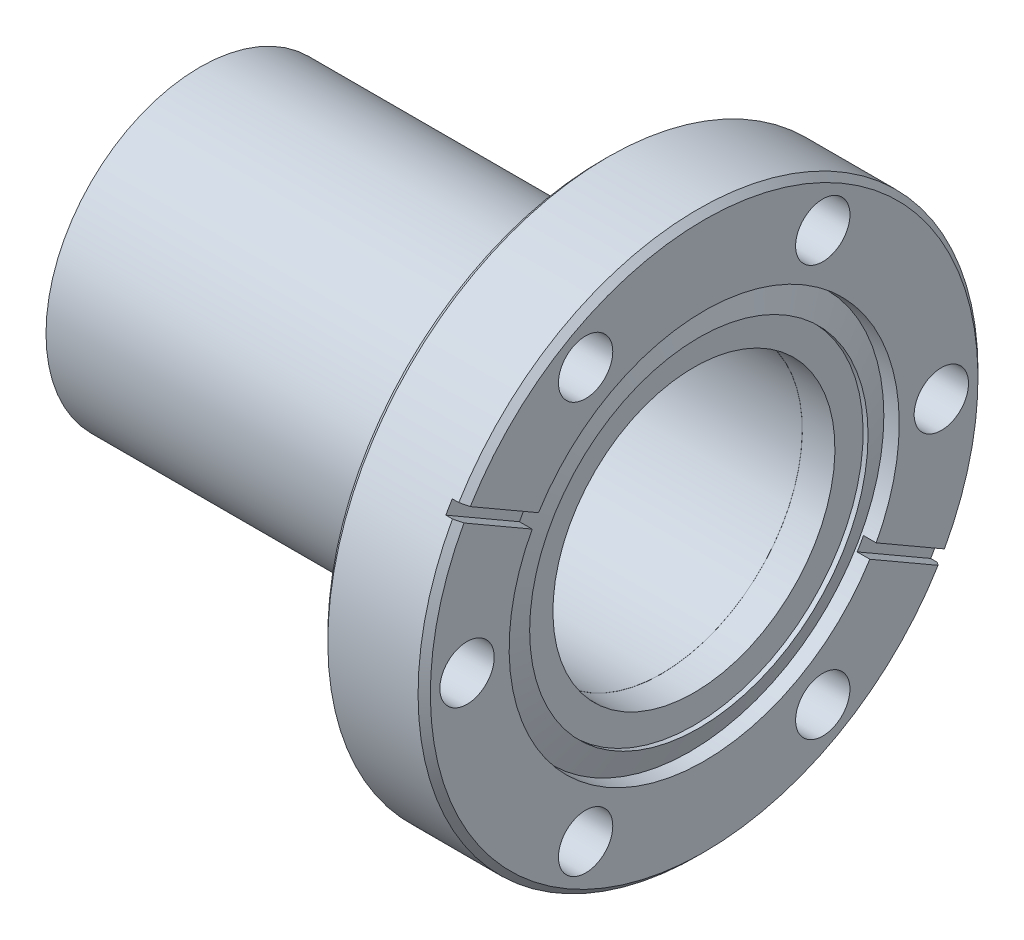
ISO-10303-21;
HEADER;
FILE_DESCRIPTION(('STEP AP214'),'2;1');
FILE_NAME('part.step','',(''),(''),'','','');
FILE_SCHEMA(('AUTOMOTIVE_DESIGN { 1 0 10303 214 1 1 1 1 }'));
ENDSEC;
DATA;
#1=APPLICATION_CONTEXT('core data for automotive mechanical design processes');
#2=APPLICATION_PROTOCOL_DEFINITION('international standard','automotive_design',2000,#1);
#3=PRODUCT_CONTEXT('',#1,'mechanical');
#4=PRODUCT('Part','Part','',(#3));
#5=PRODUCT_RELATED_PRODUCT_CATEGORY('part','',(#4));
#6=PRODUCT_DEFINITION_FORMATION('','',#4);
#7=PRODUCT_DEFINITION_CONTEXT('part definition',#1,'design');
#8=PRODUCT_DEFINITION('design','',#6,#7);
#9=PRODUCT_DEFINITION_SHAPE('','',#8);
#10=(LENGTH_UNIT() NAMED_UNIT(*) SI_UNIT(.MILLI.,.METRE.));
#11=(NAMED_UNIT(*) PLANE_ANGLE_UNIT() SI_UNIT($,.RADIAN.));
#12=(NAMED_UNIT(*) SI_UNIT($,.STERADIAN.) SOLID_ANGLE_UNIT());
#13=UNCERTAINTY_MEASURE_WITH_UNIT(LENGTH_MEASURE(1.E-05),#10,'distance_accuracy_value','');
#14=(GEOMETRIC_REPRESENTATION_CONTEXT(3) GLOBAL_UNCERTAINTY_ASSIGNED_CONTEXT((#13)) GLOBAL_UNIT_ASSIGNED_CONTEXT((#10,
#11,#12)) REPRESENTATION_CONTEXT('',''));
#15=CARTESIAN_POINT('',(0.,0.,0.));
#16=DIRECTION('',(0.,0.,1.));
#17=DIRECTION('',(1.,0.,0.));
#18=AXIS2_PLACEMENT_3D('',#15,#16,#17);
#19=CARTESIAN_POINT('',(7.39140000000005,0.,0.));
#20=DIRECTION('',(-1.,0.,0.));
#21=DIRECTION('',(0.,-1.,0.));
#22=AXIS2_PLACEMENT_3D('',#19,#20,#21);
#23=CYLINDRICAL_SURFACE('',#22,17.4498);
#24=CARTESIAN_POINT('',(7.39140000000005,0.,0.));
#25=DIRECTION('',(-1.,0.,0.));
#26=DIRECTION('',(0.,-1.,0.));
#27=AXIS2_PLACEMENT_3D('',#24,#25,#26);
#28=CIRCLE('',#27,17.4498);
#29=CARTESIAN_POINT('',(7.39140000000005,-17.4498,0.));
#30=VERTEX_POINT('',#29);
#31=EDGE_CURVE('P0_E33',#30,#30,#28,.F.);
#32=ORIENTED_EDGE('',*,*,#31,.T.);
#33=EDGE_LOOP('',(#32));
#34=FACE_BOUND('',#33,.T.);
#35=CARTESIAN_POINT('',(-47.2185999999999,0.,0.));
#36=DIRECTION('',(-1.,0.,0.));
#37=DIRECTION('',(0.,-1.,0.));
#38=AXIS2_PLACEMENT_3D('',#35,#36,#37);
#39=CIRCLE('',#38,17.4498);
#40=CARTESIAN_POINT('',(-47.2186,-17.4498,0.));
#41=VERTEX_POINT('',#40);
#42=EDGE_CURVE('P0_E10',#41,#41,#39,.F.);
#43=ORIENTED_EDGE('',*,*,#42,.F.);
#44=EDGE_LOOP('',(#43));
#45=FACE_BOUND('',#44,.T.);
#46=ADVANCED_FACE('P0_F30',(#34,#45),#23,.F.);
#47=CARTESIAN_POINT('',(-49.7585999999999,0.,0.));
#48=DIRECTION('',(-1.,0.,0.));
#49=DIRECTION('',(0.,-1.,0.));
#50=AXIS2_PLACEMENT_3D('',#47,#48,#49);
#51=PLANE('',#50);
#52=CARTESIAN_POINT('',(-49.7585999999999,0.,0.));
#53=DIRECTION('',(1.,0.,0.));
#54=DIRECTION('',(0.,1.,0.));
#55=AXIS2_PLACEMENT_3D('',#52,#53,#54);
#56=CIRCLE('',#55,19.05);
#57=CARTESIAN_POINT('',(-49.7585999999999,19.05,0.));
#58=VERTEX_POINT('',#57);
#59=EDGE_CURVE('P0_E42',#58,#58,#56,.T.);
#60=ORIENTED_EDGE('',*,*,#59,.F.);
#61=EDGE_LOOP('',(#60));
#62=FACE_BOUND('',#61,.T.);
#63=ADVANCED_FACE('P0_F55',(#62),#51,.T.);
#64=CARTESIAN_POINT('',(7.39140000000005,0.,0.));
#65=DIRECTION('',(-1.,0.,0.));
#66=DIRECTION('',(0.,-1.,0.));
#67=AXIS2_PLACEMENT_3D('',#64,#65,#66);
#68=PLANE('',#67);
#69=CARTESIAN_POINT('',(7.39140000000006,0.,0.));
#70=DIRECTION('',(1.,0.,0.));
#71=DIRECTION('',(0.,1.,0.));
#72=AXIS2_PLACEMENT_3D('',#69,#70,#71);
#73=CIRCLE('',#72,19.05);
#74=CARTESIAN_POINT('',(7.39140000000006,19.05,0.));
#75=VERTEX_POINT('',#74);
#76=EDGE_CURVE('P0_E37',#75,#75,#73,.F.);
#77=ORIENTED_EDGE('',*,*,#76,.F.);
#78=EDGE_LOOP('',(#77));
#79=FACE_BOUND('',#78,.T.);
#80=ORIENTED_EDGE('',*,*,#31,.F.);
#81=EDGE_LOOP('',(#80));
#82=FACE_BOUND('',#81,.T.);
#83=ADVANCED_FACE('P0_F52',(#79,#82),#68,.F.);
#84=CARTESIAN_POINT('',(-49.7585999999999,0.,0.));
#85=DIRECTION('',(1.,0.,0.));
#86=DIRECTION('',(0.,1.,0.));
#87=AXIS2_PLACEMENT_3D('',#84,#85,#86);
#88=CYLINDRICAL_SURFACE('',#87,19.05);
#89=ORIENTED_EDGE('',*,*,#59,.T.);
#90=EDGE_LOOP('',(#89));
#91=FACE_BOUND('',#90,.T.);
#92=ORIENTED_EDGE('',*,*,#76,.T.);
#93=EDGE_LOOP('',(#92));
#94=FACE_BOUND('',#93,.T.);
#95=ADVANCED_FACE('P0_F54',(#91,#94),#88,.T.);
#96=CARTESIAN_POINT('',(-47.2185999999999,0.,0.));
#97=DIRECTION('',(-1.,0.,0.));
#98=DIRECTION('',(0.,-1.,0.));
#99=AXIS2_PLACEMENT_3D('',#96,#97,#98);
#100=PLANE('',#99);
#101=ORIENTED_EDGE('',*,*,#42,.T.);
#102=EDGE_LOOP('',(#101));
#103=FACE_BOUND('',#102,.T.);
#104=ADVANCED_FACE('P0_F62',(#103),#100,.F.);
#105=CLOSED_SHELL('',(#46,#63,#83,#95,#104));
#106=MANIFOLD_SOLID_BREP('P0_B2',#105);
#107=CARTESIAN_POINT('',(11.43,-14.1065506182447,15.4957173004317));
#108=DIRECTION('',(1.,0.,0.));
#109=DIRECTION('',(0.,0.,-1.));
#110=AXIS2_PLACEMENT_3D('',#107,#108,#109);
#111=PLANE('',#110);
#112=CARTESIAN_POINT('',(11.4300000000001,0.,0.));
#113=DIRECTION('',(-1.,0.,0.));
#114=DIRECTION('',(0.,-1.,0.));
#115=AXIS2_PLACEMENT_3D('',#112,#113,#114);
#116=CIRCLE('',#115,20.9550000000001);
#117=CARTESIAN_POINT('',(11.4300000000001,-20.9550000000001,0.));
#118=VERTEX_POINT('',#117);
#119=EDGE_CURVE('P1_E17',#118,#118,#116,.F.);
#120=ORIENTED_EDGE('',*,*,#119,.T.);
#121=EDGE_LOOP('',(#120));
#122=FACE_BOUND('',#121,.T.);
#123=CARTESIAN_POINT('',(11.4300000000001,0.,0.));
#124=DIRECTION('',(-1.,0.,0.));
#125=DIRECTION('',(0.,-1.,0.));
#126=AXIS2_PLACEMENT_3D('',#123,#124,#125);
#127=CIRCLE('',#126,17.4625);
#128=CARTESIAN_POINT('',(11.4300000000001,-17.4625,0.));
#129=VERTEX_POINT('',#128);
#130=EDGE_CURVE('P1_E39',#129,#129,#127,.T.);
#131=ORIENTED_EDGE('',*,*,#130,.T.);
#132=EDGE_LOOP('',(#131));
#133=FACE_BOUND('',#132,.T.);
#134=ADVANCED_FACE('P1_F14',(#122,#133),#111,.T.);
#135=CARTESIAN_POINT('',(12.0396000000005,0.,0.));
#136=DIRECTION('',(-1.,0.,0.));
#137=DIRECTION('',(0.,-1.,0.));
#138=AXIS2_PLACEMENT_3D('',#135,#136,#137);
#139=CYLINDRICAL_SURFACE('',#138,20.9550000000001);
#140=CARTESIAN_POINT('',(12.0396000000004,0.,0.));
#141=DIRECTION('',(-1.,0.,0.));
#142=DIRECTION('',(0.,0.673183040717958,-0.739475891216018));
#143=AXIS2_PLACEMENT_3D('',#140,#141,#142);
#144=CIRCLE('',#143,20.9550000000004);
#145=CARTESIAN_POINT('',(12.0396000000004,14.1065506182451,-15.4957173004319));
#146=VERTEX_POINT('',#145);
#147=EDGE_CURVE('P1_E29',#146,#146,#144,.T.);
#148=ORIENTED_EDGE('',*,*,#147,.F.);
#149=EDGE_LOOP('',(#148));
#150=FACE_BOUND('',#149,.T.);
#151=ORIENTED_EDGE('',*,*,#119,.F.);
#152=EDGE_LOOP('',(#151));
#153=FACE_BOUND('',#152,.T.);
#154=ADVANCED_FACE('P1_F48',(#150,#153),#139,.F.);
#155=CARTESIAN_POINT('',(12.0396000000005,0.,0.));
#156=DIRECTION('',(-1.,0.,0.));
#157=DIRECTION('',(0.,-1.,0.));
#158=AXIS2_PLACEMENT_3D('',#155,#156,#157);
#159=CYLINDRICAL_SURFACE('',#158,17.4625);
#160=CARTESIAN_POINT('',(7.3914000000001,0.,0.));
#161=DIRECTION('',(-1.,0.,0.));
#162=DIRECTION('',(0.,-1.,0.));
#163=AXIS2_PLACEMENT_3D('',#160,#161,#162);
#164=CIRCLE('',#163,17.4625);
#165=CARTESIAN_POINT('',(7.3914000000001,-17.4625,0.));
#166=VERTEX_POINT('',#165);
#167=EDGE_CURVE('P1_E37',#166,#166,#164,.F.);
#168=ORIENTED_EDGE('',*,*,#167,.F.);
#169=EDGE_LOOP('',(#168));
#170=FACE_BOUND('',#169,.T.);
#171=ORIENTED_EDGE('',*,*,#130,.F.);
#172=EDGE_LOOP('',(#171));
#173=FACE_BOUND('',#172,.T.);
#174=ADVANCED_FACE('P1_F50',(#170,#173),#159,.F.);
#175=CARTESIAN_POINT('',(10.9209738820066,0.,0.));
#176=DIRECTION('',(-1.,0.,0.));
#177=DIRECTION('',(0.,-1.,0.));
#178=AXIS2_PLACEMENT_3D('',#175,#176,#177);
#179=CONICAL_SURFACE('',#178,24.0283999999998,1.22173047639595);
#180=CARTESIAN_POINT('',(10.9209738820065,0.,0.));
#181=DIRECTION('',(-1.,0.,0.));
#182=DIRECTION('',(0.,-1.,0.));
#183=AXIS2_PLACEMENT_3D('',#180,#181,#182);
#184=CIRCLE('',#183,24.0284);
#185=CARTESIAN_POINT('',(10.9209738820065,-24.0284,0.));
#186=VERTEX_POINT('',#185);
#187=EDGE_CURVE('P1_E36',#186,#186,#184,.T.);
#188=ORIENTED_EDGE('',*,*,#187,.F.);
#189=EDGE_LOOP('',(#188));
#190=FACE_BOUND('',#189,.T.);
#191=ORIENTED_EDGE('',*,*,#147,.T.);
#192=EDGE_LOOP('',(#191));
#193=FACE_BOUND('',#192,.T.);
#194=ADVANCED_FACE('P1_F57',(#190,#193),#179,.T.);
#195=CARTESIAN_POINT('',(7.39140000000005,-11.7554588485375,12.9130977503597));
#196=DIRECTION('',(-1.,0.,0.));
#197=DIRECTION('',(0.,0.,1.));
#198=AXIS2_PLACEMENT_3D('',#195,#196,#197);
#199=PLANE('',#198);
#200=ORIENTED_EDGE('',*,*,#167,.T.);
#201=EDGE_LOOP('',(#200));
#202=FACE_BOUND('',#201,.T.);
#203=CARTESIAN_POINT('',(7.39140000000007,0.,0.));
#204=DIRECTION('',(-1.,0.,0.));
#205=DIRECTION('',(0.,-1.,0.));
#206=AXIS2_PLACEMENT_3D('',#203,#204,#205);
#207=CIRCLE('',#206,19.177);
#208=CARTESIAN_POINT('',(7.39140000000007,-19.177,0.));
#209=VERTEX_POINT('',#208);
#210=EDGE_CURVE('P1_E32',#209,#209,#207,.T.);
#211=ORIENTED_EDGE('',*,*,#210,.T.);
#212=EDGE_LOOP('',(#211));
#213=FACE_BOUND('',#212,.T.);
#214=ADVANCED_FACE('P1_F83',(#202,#213),#199,.T.);
#215=CARTESIAN_POINT('',(12.0396000000005,0.,0.));
#216=DIRECTION('',(-1.,0.,0.));
#217=DIRECTION('',(0.,-1.,0.));
#218=AXIS2_PLACEMENT_3D('',#215,#216,#217);
#219=CYLINDRICAL_SURFACE('',#218,24.0284);
#220=CARTESIAN_POINT('',(5.84199999999986,0.,0.));
#221=DIRECTION('',(1.,0.,0.));
#222=DIRECTION('',(0.,-0.673183040717958,0.739475891216018));
#223=AXIS2_PLACEMENT_3D('',#220,#221,#222);
#224=CIRCLE('',#223,24.0284);
#225=CARTESIAN_POINT('',(5.84199999999986,-16.1755113755874,17.7684225044949));
#226=VERTEX_POINT('',#225);
#227=EDGE_CURVE('P1_E35',#226,#226,#224,.F.);
#228=ORIENTED_EDGE('',*,*,#227,.F.);
#229=EDGE_LOOP('',(#228));
#230=FACE_BOUND('',#229,.T.);
#231=ORIENTED_EDGE('',*,*,#187,.T.);
#232=EDGE_LOOP('',(#231));
#233=FACE_BOUND('',#232,.T.);
#234=ADVANCED_FACE('P1_F79',(#230,#233),#219,.T.);
#235=CARTESIAN_POINT('',(12.0396000000005,0.,0.));
#236=DIRECTION('',(-1.,0.,0.));
#237=DIRECTION('',(0.,-1.,0.));
#238=AXIS2_PLACEMENT_3D('',#235,#236,#237);
#239=CYLINDRICAL_SURFACE('',#238,19.177);
#240=CARTESIAN_POINT('',(5.84200000000009,0.,0.));
#241=DIRECTION('',(-1.,0.,0.));
#242=DIRECTION('',(0.,0.673183040717958,-0.739475891216018));
#243=AXIS2_PLACEMENT_3D('',#240,#241,#242);
#244=CIRCLE('',#243,19.177);
#245=CARTESIAN_POINT('',(5.84200000000009,12.9096311718483,-14.1809291658496));
#246=VERTEX_POINT('',#245);
#247=EDGE_CURVE('P1_E26',#246,#246,#244,.T.);
#248=ORIENTED_EDGE('',*,*,#247,.T.);
#249=EDGE_LOOP('',(#248));
#250=FACE_BOUND('',#249,.T.);
#251=ORIENTED_EDGE('',*,*,#210,.F.);
#252=EDGE_LOOP('',(#251));
#253=FACE_BOUND('',#252,.T.);
#254=ADVANCED_FACE('P1_F75',(#250,#253),#239,.F.);
#255=CARTESIAN_POINT('',(5.84199999999986,0.,0.));
#256=DIRECTION('',(1.,0.,0.));
#257=DIRECTION('',(0.,1.,0.));
#258=AXIS2_PLACEMENT_3D('',#255,#256,#257);
#259=CONICAL_SURFACE('',#258,24.0284,0.785398163397482);
#260=ORIENTED_EDGE('',*,*,#227,.T.);
#261=EDGE_LOOP('',(#260));
#262=FACE_BOUND('',#261,.T.);
#263=CARTESIAN_POINT('',(5.08000000000002,0.,0.));
#264=DIRECTION('',(1.,0.,0.));
#265=DIRECTION('',(0.,1.,0.));
#266=AXIS2_PLACEMENT_3D('',#263,#264,#265);
#267=CIRCLE('',#266,23.2664000000001);
#268=CARTESIAN_POINT('',(5.08000000000003,23.2664000000001,0.));
#269=VERTEX_POINT('',#268);
#270=EDGE_CURVE('P1_E21',#269,#269,#267,.F.);
#271=ORIENTED_EDGE('',*,*,#270,.F.);
#272=EDGE_LOOP('',(#271));
#273=FACE_BOUND('',#272,.T.);
#274=ADVANCED_FACE('P1_F68',(#262,#273),#259,.T.);
#275=CARTESIAN_POINT('',(5.07999999999999,0.,0.));
#276=DIRECTION('',(-1.,0.,0.));
#277=DIRECTION('',(0.,-1.,0.));
#278=AXIS2_PLACEMENT_3D('',#275,#276,#277);
#279=CONICAL_SURFACE('',#278,19.9389999999999,0.785398163397347);
#280=CARTESIAN_POINT('',(5.08000000000003,0.,0.));
#281=DIRECTION('',(-1.,0.,0.));
#282=DIRECTION('',(0.,-1.,0.));
#283=AXIS2_PLACEMENT_3D('',#280,#281,#282);
#284=CIRCLE('',#283,19.9389999999999);
#285=CARTESIAN_POINT('',(5.08000000000003,-19.9389999999999,0.));
#286=VERTEX_POINT('',#285);
#287=EDGE_CURVE('P1_E10',#286,#286,#284,.F.);
#288=ORIENTED_EDGE('',*,*,#287,.F.);
#289=EDGE_LOOP('',(#288));
#290=FACE_BOUND('',#289,.T.);
#291=ORIENTED_EDGE('',*,*,#247,.F.);
#292=EDGE_LOOP('',(#291));
#293=FACE_BOUND('',#292,.T.);
#294=ADVANCED_FACE('P1_F63',(#290,#293),#279,.F.);
#295=CARTESIAN_POINT('',(5.08,-13.4225966488754,14.7444097949561));
#296=DIRECTION('',(-1.,0.,0.));
#297=DIRECTION('',(0.,0.,1.));
#298=AXIS2_PLACEMENT_3D('',#295,#296,#297);
#299=PLANE('',#298);
#300=ORIENTED_EDGE('',*,*,#287,.T.);
#301=EDGE_LOOP('',(#300));
#302=FACE_BOUND('',#301,.T.);
#303=ORIENTED_EDGE('',*,*,#270,.T.);
#304=EDGE_LOOP('',(#303));
#305=FACE_BOUND('',#304,.T.);
#306=ADVANCED_FACE('P1_F61',(#302,#305),#299,.T.);
#307=CLOSED_SHELL('',(#134,#154,#174,#194,#214,#234,#254,#274,#294,#306));
#308=MANIFOLD_SOLID_BREP('P1_B1',#307);
#309=CARTESIAN_POINT('',(11.1252,0.,0.));
#310=DIRECTION('',(1.,0.,0.));
#311=DIRECTION('',(0.,1.,0.));
#312=AXIS2_PLACEMENT_3D('',#309,#310,#311);
#313=PLANE('',#312);
#314=CARTESIAN_POINT('',(11.1252,0.,0.));
#315=DIRECTION('',(-1.,0.,0.));
#316=DIRECTION('',(0.,0.,1.));
#317=AXIS2_PLACEMENT_3D('',#314,#315,#316);
#318=CIRCLE('',#317,34.671);
#319=CARTESIAN_POINT('',(11.1252,18.0129372402592,29.6245224936789));
#320=VERTEX_POINT('',#319);
#321=CARTESIAN_POINT('',(11.1252,16.6491204343794,30.4119224936789));
#322=VERTEX_POINT('',#321);
#323=EDGE_CURVE('P2_E98',#320,#322,#318,.F.);
#324=ORIENTED_EDGE('',*,*,#323,.T.);
#325=DIRECTION('',(0.,-0.499999999999993,-0.866025403784442));
#326=VECTOR('',#325,1.);
#327=CARTESIAN_POINT('',(11.1252,11.3893731197485,21.3017729097639));
#328=LINE('',#327,#326);
#329=CARTESIAN_POINT('',(11.1252,11.3893731197485,21.3017729097639));
#330=VERTEX_POINT('',#329);
#331=EDGE_CURVE('P2_E96',#322,#330,#328,.T.);
#332=ORIENTED_EDGE('',*,*,#331,.T.);
#333=CARTESIAN_POINT('',(11.1252,0.,0.));
#334=DIRECTION('',(1.,0.,0.));
#335=DIRECTION('',(0.,0.,-1.));
#336=AXIS2_PLACEMENT_3D('',#333,#334,#335);
#337=CIRCLE('',#336,24.1554);
#338=CARTESIAN_POINT('',(11.1252,12.7531899256282,20.5143729097639));
#339=VERTEX_POINT('',#338);
#340=EDGE_CURVE('P2_E19',#330,#339,#337,.F.);
#341=ORIENTED_EDGE('',*,*,#340,.T.);
#342=DIRECTION('',(0.,0.499999999999994,0.866025403784442));
#343=VECTOR('',#342,1.);
#344=CARTESIAN_POINT('',(11.1252,18.0129372402592,29.6245224936789));
#345=LINE('',#344,#343);
#346=EDGE_CURVE('P2_E93',#339,#320,#345,.T.);
#347=ORIENTED_EDGE('',*,*,#346,.T.);
#348=EDGE_LOOP('',(#324,#332,#341,#347));
#349=FACE_BOUND('',#348,.T.);
#350=ADVANCED_FACE('P2_F16',(#349),#313,.T.);
#351=CARTESIAN_POINT('',(11.1252,0.,0.));
#352=DIRECTION('',(1.,0.,0.));
#353=DIRECTION('',(0.,1.,0.));
#354=AXIS2_PLACEMENT_3D('',#351,#352,#353);
#355=PLANE('',#354);
#356=CARTESIAN_POINT('',(11.1252,0.,0.));
#357=DIRECTION('',(-1.,0.,0.));
#358=DIRECTION('',(0.,0.,1.));
#359=AXIS2_PLACEMENT_3D('',#356,#357,#358);
#360=CIRCLE('',#359,34.671);
#361=CARTESIAN_POINT('',(11.1252,-18.0129372402594,-29.6245224936787));
#362=VERTEX_POINT('',#361);
#363=CARTESIAN_POINT('',(11.1252,-16.6491204343796,-30.4119224936787));
#364=VERTEX_POINT('',#363);
#365=EDGE_CURVE('P2_E152',#362,#364,#360,.F.);
#366=ORIENTED_EDGE('',*,*,#365,.T.);
#367=DIRECTION('',(0.,0.5,0.866025403784439));
#368=VECTOR('',#367,1.);
#369=CARTESIAN_POINT('',(11.1252,-11.3893731197486,-21.3017729097638));
#370=LINE('',#369,#368);
#371=CARTESIAN_POINT('',(11.1252,-11.3893731197486,-21.3017729097638));
#372=VERTEX_POINT('',#371);
#373=EDGE_CURVE('P2_E149',#364,#372,#370,.T.);
#374=ORIENTED_EDGE('',*,*,#373,.T.);
#375=CARTESIAN_POINT('',(11.1252,0.,0.));
#376=DIRECTION('',(1.,0.,0.));
#377=DIRECTION('',(0.,0.,-1.));
#378=AXIS2_PLACEMENT_3D('',#375,#376,#377);
#379=CIRCLE('',#378,24.1554);
#380=CARTESIAN_POINT('',(11.1252,-12.7531899256283,-20.5143729097638));
#381=VERTEX_POINT('',#380);
#382=EDGE_CURVE('P2_E344',#372,#381,#379,.F.);
#383=ORIENTED_EDGE('',*,*,#382,.T.);
#384=DIRECTION('',(0.,-0.5,-0.866025403784439));
#385=VECTOR('',#384,1.);
#386=CARTESIAN_POINT('',(11.1252,-18.0129372402594,-29.6245224936787));
#387=LINE('',#386,#385);
#388=EDGE_CURVE('P2_E135',#381,#362,#387,.T.);
#389=ORIENTED_EDGE('',*,*,#388,.T.);
#390=EDGE_LOOP('',(#366,#374,#383,#389));
#391=FACE_BOUND('',#390,.T.);
#392=ADVANCED_FACE('P2_F259',(#391),#355,.T.);
#393=CARTESIAN_POINT('',(5.08,0.,0.));
#394=DIRECTION('',(1.,0.,0.));
#395=DIRECTION('',(0.,1.,0.));
#396=AXIS2_PLACEMENT_3D('',#393,#394,#395);
#397=PLANE('',#396);
#398=CARTESIAN_POINT('',(5.08,0.,0.));
#399=DIRECTION('',(1.,0.,0.));
#400=DIRECTION('',(0.,0.,-1.));
#401=AXIS2_PLACEMENT_3D('',#398,#399,#400);
#402=CIRCLE('',#401,19.812);
#403=CARTESIAN_POINT('',(5.08,0.,-19.812));
#404=VERTEX_POINT('',#403);
#405=EDGE_CURVE('P2_E128',#404,#404,#402,.F.);
#406=ORIENTED_EDGE('',*,*,#405,.T.);
#407=EDGE_LOOP('',(#406));
#408=FACE_BOUND('',#407,.T.);
#409=CARTESIAN_POINT('',(5.08,0.,0.));
#410=DIRECTION('',(1.,0.,0.));
#411=DIRECTION('',(0.,0.,-1.));
#412=AXIS2_PLACEMENT_3D('',#409,#410,#411);
#413=CIRCLE('',#412,24.1554);
#414=CARTESIAN_POINT('',(5.08,0.,-24.1554));
#415=VERTEX_POINT('',#414);
#416=EDGE_CURVE('P2_E114',#415,#415,#413,.T.);
#417=ORIENTED_EDGE('',*,*,#416,.T.);
#418=EDGE_LOOP('',(#417));
#419=FACE_BOUND('',#418,.T.);
#420=ADVANCED_FACE('P2_F256',(#408,#419),#397,.T.);
#421=CARTESIAN_POINT('',(11.1252,-11.3893731197486,-21.3017729097638));
#422=DIRECTION('',(0.,0.866025403784439,-0.5));
#423=DIRECTION('',(0.,0.5,0.866025403784439));
#424=AXIS2_PLACEMENT_3D('',#421,#422,#423);
#425=PLANE('',#424);
#426=CARTESIAN_POINT('',(12.7,-16.2680199320119,-29.7518370607878));
#427=CARTESIAN_POINT('',(12.5730003723783,-16.3315368685465,-29.8618516220069));
#428=CARTESIAN_POINT('',(12.4460005585674,-16.3950537120112,-29.9718660220241));
#429=CARTESIAN_POINT('',(12.1920005585674,-16.5220872128004,-30.1918944996544));
#430=CARTESIAN_POINT('',(12.0650003723783,-16.585603870125,-30.3019085772676));
#431=CARTESIAN_POINT('',(11.938,-16.6491204343796,-30.4119224936787));
#432=B_SPLINE_CURVE_WITH_KNOTS('',3,(#426,#427,#428,#429,#430,#431),.UNSPECIFIED.,.F.,.F.,(4,2,
4),(0.,0.538886437856431,1.07777287571284),.UNSPECIFIED.);
#433=CARTESIAN_POINT('',(12.7,-16.2680199320119,-29.7518370607878));
#434=VERTEX_POINT('',#433);
#435=CARTESIAN_POINT('',(11.938,-16.6491204343796,-30.4119224936787));
#436=VERTEX_POINT('',#435);
#437=EDGE_CURVE('P2_E108',#434,#436,#432,.T.);
#438=ORIENTED_EDGE('',*,*,#437,.F.);
#439=DIRECTION('',(0.,-0.499999999999999,-0.866025403784439));
#440=VECTOR('',#439,1.);
#441=CARTESIAN_POINT('',(12.7,-11.3893731197486,-21.3017729097638));
#442=LINE('',#441,#440);
#443=CARTESIAN_POINT('',(12.7,-11.3893731197486,-21.3017729097638));
#444=VERTEX_POINT('',#443);
#445=EDGE_CURVE('P2_E204',#444,#434,#442,.T.);
#446=ORIENTED_EDGE('',*,*,#445,.F.);
#447=DIRECTION('',(1.,0.,0.));
#448=VECTOR('',#447,1.);
#449=CARTESIAN_POINT('',(5.08,-11.3893731197486,-21.3017729097638));
#450=LINE('',#449,#448);
#451=EDGE_CURVE('P2_E124',#444,#372,#450,.F.);
#452=ORIENTED_EDGE('',*,*,#451,.T.);
#453=ORIENTED_EDGE('',*,*,#373,.F.);
#454=DIRECTION('',(-1.,0.,0.));
#455=VECTOR('',#454,1.);
#456=CARTESIAN_POINT('',(12.7,-16.6491204343796,-30.4119224936787));
#457=LINE('',#456,#455);
#458=EDGE_CURVE('P2_E134',#436,#364,#457,.T.);
#459=ORIENTED_EDGE('',*,*,#458,.F.);
#460=EDGE_LOOP('',(#438,#446,#452,#453,#459));
#461=FACE_BOUND('',#460,.T.);
#462=ADVANCED_FACE('P2_F252',(#461),#425,.F.);
#463=CARTESIAN_POINT('',(11.938,0.,0.));
#464=DIRECTION('',(-1.,0.,0.));
#465=DIRECTION('',(0.,0.,1.));
#466=AXIS2_PLACEMENT_3D('',#463,#464,#465);
#467=CONICAL_SURFACE('',#466,34.671,0.785398163397442);
#468=CARTESIAN_POINT('',(11.938,18.0129372402592,29.6245224936789));
#469=CARTESIAN_POINT('',(12.0650003723783,17.9494206760046,29.5145085772677));
#470=CARTESIAN_POINT('',(12.1920005585674,17.88590401868,29.4044944996545));
#471=CARTESIAN_POINT('',(12.4460005585674,17.7588705178907,29.1844660220242));
#472=CARTESIAN_POINT('',(12.5730003723783,17.6953536744261,29.0744516220071));
#473=CARTESIAN_POINT('',(12.7,17.6318367378914,28.9644370607879));
#474=B_SPLINE_CURVE_WITH_KNOTS('',3,(#468,#469,#470,#471,#472,#473),.UNSPECIFIED.,.F.,.F.,(4,2,
4),(0.,0.538886437856404,1.07777287571283),.UNSPECIFIED.);
#475=CARTESIAN_POINT('',(11.938,18.0129372402592,29.6245224936789));
#476=VERTEX_POINT('',#475);
#477=CARTESIAN_POINT('',(12.7,17.6318367378914,28.9644370607879));
#478=VERTEX_POINT('',#477);
#479=EDGE_CURVE('P2_E107',#476,#478,#474,.T.);
#480=ORIENTED_EDGE('',*,*,#479,.T.);
#481=CARTESIAN_POINT('',(12.7,0.,0.));
#482=DIRECTION('',(-1.,0.,0.));
#483=DIRECTION('',(0.,0.,1.));
#484=AXIS2_PLACEMENT_3D('',#481,#482,#483);
#485=CIRCLE('',#484,33.909);
#486=EDGE_CURVE('P2_E202',#434,#478,#485,.F.);
#487=ORIENTED_EDGE('',*,*,#486,.F.);
#488=ORIENTED_EDGE('',*,*,#437,.T.);
#489=CARTESIAN_POINT('',(11.938,0.,0.));
#490=DIRECTION('',(-1.,0.,0.));
#491=DIRECTION('',(0.,0.,1.));
#492=AXIS2_PLACEMENT_3D('',#489,#490,#491);
#493=CIRCLE('',#492,34.671);
#494=EDGE_CURVE('P2_E140',#476,#436,#493,.T.);
#495=ORIENTED_EDGE('',*,*,#494,.F.);
#496=EDGE_LOOP('',(#480,#487,#488,#495));
#497=FACE_BOUND('',#496,.T.);
#498=ADVANCED_FACE('P2_F237',(#497),#467,.T.);
#499=CARTESIAN_POINT('',(11.1252,18.0129372402592,29.6245224936789));
#500=DIRECTION('',(0.,0.866025403784442,-0.499999999999994));
#501=DIRECTION('',(0.,0.499999999999994,0.866025403784442));
#502=AXIS2_PLACEMENT_3D('',#499,#500,#501);
#503=PLANE('',#502);
#504=ORIENTED_EDGE('',*,*,#479,.F.);
#505=DIRECTION('',(-1.,0.,0.));
#506=VECTOR('',#505,1.);
#507=CARTESIAN_POINT('',(12.7,18.0129372402592,29.6245224936789));
#508=LINE('',#507,#506);
#509=EDGE_CURVE('P2_E106',#320,#476,#508,.F.);
#510=ORIENTED_EDGE('',*,*,#509,.F.);
#511=ORIENTED_EDGE('',*,*,#346,.F.);
#512=DIRECTION('',(1.,0.,0.));
#513=VECTOR('',#512,1.);
#514=CARTESIAN_POINT('',(5.08,12.7531899256282,20.5143729097639));
#515=LINE('',#514,#513);
#516=CARTESIAN_POINT('',(12.7,12.7531899256282,20.5143729097639));
#517=VERTEX_POINT('',#516);
#518=EDGE_CURVE('P2_E104',#339,#517,#515,.T.);
#519=ORIENTED_EDGE('',*,*,#518,.T.);
#520=DIRECTION('',(0.,-0.499999999999994,-0.866025403784442));
#521=VECTOR('',#520,1.);
#522=CARTESIAN_POINT('',(12.7,17.6318367378914,28.9644370607879));
#523=LINE('',#522,#521);
#524=EDGE_CURVE('P2_E201',#478,#517,#523,.T.);
#525=ORIENTED_EDGE('',*,*,#524,.F.);
#526=EDGE_LOOP('',(#504,#510,#511,#519,#525));
#527=FACE_BOUND('',#526,.T.);
#528=ADVANCED_FACE('P2_F102',(#527),#503,.F.);
#529=CARTESIAN_POINT('',(11.1252,11.3893731197485,21.3017729097639));
#530=DIRECTION('',(0.,-0.866025403784442,0.499999999999993));
#531=DIRECTION('',(0.,-0.499999999999993,-0.866025403784442));
#532=AXIS2_PLACEMENT_3D('',#529,#530,#531);
#533=PLANE('',#532);
#534=CARTESIAN_POINT('',(12.7,16.2680199320117,29.7518370607879));
#535=CARTESIAN_POINT('',(12.5730003723783,16.3315368685463,29.861851622007));
#536=CARTESIAN_POINT('',(12.4460005585674,16.395053712011,29.9718660220242));
#537=CARTESIAN_POINT('',(12.1920005585674,16.5220872128002,30.1918944996545));
#538=CARTESIAN_POINT('',(12.0650003723783,16.5856038701248,30.3019085772677));
#539=CARTESIAN_POINT('',(11.938,16.6491204343794,30.4119224936789));
#540=B_SPLINE_CURVE_WITH_KNOTS('',3,(#534,#535,#536,#537,#538,#539),.UNSPECIFIED.,.F.,.F.,(4,2,
4),(0.,0.538886437856433,1.07777287571284),.UNSPECIFIED.);
#541=CARTESIAN_POINT('',(12.7,16.2680199320117,29.7518370607879));
#542=VERTEX_POINT('',#541);
#543=CARTESIAN_POINT('',(11.938,16.6491204343794,30.4119224936789));
#544=VERTEX_POINT('',#543);
#545=EDGE_CURVE('P2_E139',#542,#544,#540,.T.);
#546=ORIENTED_EDGE('',*,*,#545,.F.);
#547=DIRECTION('',(0.,0.499999999999994,0.866025403784442));
#548=VECTOR('',#547,1.);
#549=CARTESIAN_POINT('',(12.7,11.3893731197485,21.3017729097639));
#550=LINE('',#549,#548);
#551=CARTESIAN_POINT('',(12.7,11.3893731197485,21.3017729097639));
#552=VERTEX_POINT('',#551);
#553=EDGE_CURVE('P2_E199',#552,#542,#550,.T.);
#554=ORIENTED_EDGE('',*,*,#553,.F.);
#555=DIRECTION('',(1.,0.,0.));
#556=VECTOR('',#555,1.);
#557=CARTESIAN_POINT('',(5.08,11.3893731197485,21.3017729097639));
#558=LINE('',#557,#556);
#559=EDGE_CURVE('P2_E115',#552,#330,#558,.F.);
#560=ORIENTED_EDGE('',*,*,#559,.T.);
#561=ORIENTED_EDGE('',*,*,#331,.F.);
#562=DIRECTION('',(-1.,0.,0.));
#563=VECTOR('',#562,1.);
#564=CARTESIAN_POINT('',(12.7,16.6491204343794,30.4119224936789));
#565=LINE('',#564,#563);
#566=EDGE_CURVE('P2_E118',#544,#322,#565,.T.);
#567=ORIENTED_EDGE('',*,*,#566,.F.);
#568=EDGE_LOOP('',(#546,#554,#560,#561,#567));
#569=FACE_BOUND('',#568,.T.);
#570=ADVANCED_FACE('P2_F227',(#569),#533,.F.);
#571=CARTESIAN_POINT('',(11.938,0.,0.));
#572=DIRECTION('',(-1.,0.,0.));
#573=DIRECTION('',(0.,0.,1.));
#574=AXIS2_PLACEMENT_3D('',#571,#572,#573);
#575=CONICAL_SURFACE('',#574,34.671,0.785398163397452);
#576=CARTESIAN_POINT('',(11.938,0.,0.));
#577=DIRECTION('',(-1.,0.,0.));
#578=DIRECTION('',(0.,0.,1.));
#579=AXIS2_PLACEMENT_3D('',#576,#577,#578);
#580=CIRCLE('',#579,34.671);
#581=CARTESIAN_POINT('',(11.938,-18.0129372402594,-29.6245224936787));
#582=VERTEX_POINT('',#581);
#583=EDGE_CURVE('P2_E126',#582,#544,#580,.T.);
#584=ORIENTED_EDGE('',*,*,#583,.F.);
#585=CARTESIAN_POINT('',(11.938,-18.0129372402594,-29.6245224936787));
#586=CARTESIAN_POINT('',(12.0650003723783,-17.9494206760048,-29.5145085772676));
#587=CARTESIAN_POINT('',(12.1920005585674,-17.8859040186802,-29.4044944996544));
#588=CARTESIAN_POINT('',(12.4460005585674,-17.7588705178909,-29.1844660220241));
#589=CARTESIAN_POINT('',(12.5730003723783,-17.6953536744263,-29.0744516220069));
#590=CARTESIAN_POINT('',(12.7,-17.6318367378916,-28.9644370607878));
#591=B_SPLINE_CURVE_WITH_KNOTS('',3,(#585,#586,#587,#588,#589,#590),.UNSPECIFIED.,.F.,.F.,(4,2,
4),(0.,0.538886437856412,1.07777287571285),.UNSPECIFIED.);
#592=CARTESIAN_POINT('',(12.7,-17.6318367378916,-28.9644370607878));
#593=VERTEX_POINT('',#592);
#594=EDGE_CURVE('P2_E138',#582,#593,#591,.T.);
#595=ORIENTED_EDGE('',*,*,#594,.T.);
#596=CARTESIAN_POINT('',(12.7,0.,0.));
#597=DIRECTION('',(-1.,0.,0.));
#598=DIRECTION('',(0.,0.,1.));
#599=AXIS2_PLACEMENT_3D('',#596,#597,#598);
#600=CIRCLE('',#599,33.909);
#601=EDGE_CURVE('P2_E197',#542,#593,#600,.F.);
#602=ORIENTED_EDGE('',*,*,#601,.F.);
#603=ORIENTED_EDGE('',*,*,#545,.T.);
#604=EDGE_LOOP('',(#584,#595,#602,#603));
#605=FACE_BOUND('',#604,.T.);
#606=ADVANCED_FACE('P2_F224',(#605),#575,.T.);
#607=CARTESIAN_POINT('',(11.1252,-18.0129372402594,-29.6245224936787));
#608=DIRECTION('',(0.,-0.866025403784439,0.5));
#609=DIRECTION('',(0.,-0.5,-0.866025403784439));
#610=AXIS2_PLACEMENT_3D('',#607,#608,#609);
#611=PLANE('',#610);
#612=ORIENTED_EDGE('',*,*,#594,.F.);
#613=DIRECTION('',(-1.,0.,0.));
#614=VECTOR('',#613,1.);
#615=CARTESIAN_POINT('',(12.7,-18.0129372402594,-29.6245224936787));
#616=LINE('',#615,#614);
#617=EDGE_CURVE('P2_E129',#362,#582,#616,.F.);
#618=ORIENTED_EDGE('',*,*,#617,.F.);
#619=ORIENTED_EDGE('',*,*,#388,.F.);
#620=DIRECTION('',(1.,0.,0.));
#621=VECTOR('',#620,1.);
#622=CARTESIAN_POINT('',(5.08,-12.7531899256283,-20.5143729097638));
#623=LINE('',#622,#621);
#624=CARTESIAN_POINT('',(12.7,-12.7531899256283,-20.5143729097638));
#625=VERTEX_POINT('',#624);
#626=EDGE_CURVE('P2_E120',#381,#625,#623,.T.);
#627=ORIENTED_EDGE('',*,*,#626,.T.);
#628=DIRECTION('',(0.,0.5,0.866025403784439));
#629=VECTOR('',#628,1.);
#630=CARTESIAN_POINT('',(12.7,-17.6318367378916,-28.9644370607878));
#631=LINE('',#630,#629);
#632=EDGE_CURVE('P2_E196',#593,#625,#631,.T.);
#633=ORIENTED_EDGE('',*,*,#632,.F.);
#634=EDGE_LOOP('',(#612,#618,#619,#627,#633));
#635=FACE_BOUND('',#634,.T.);
#636=ADVANCED_FACE('P2_F221',(#635),#611,.F.);
#637=CARTESIAN_POINT('',(5.08,0.,0.));
#638=DIRECTION('',(1.,0.,0.));
#639=DIRECTION('',(0.,0.,-1.));
#640=AXIS2_PLACEMENT_3D('',#637,#638,#639);
#641=CYLINDRICAL_SURFACE('',#640,24.1554);
#642=ORIENTED_EDGE('',*,*,#416,.F.);
#643=EDGE_LOOP('',(#642));
#644=FACE_BOUND('',#643,.T.);
#645=CARTESIAN_POINT('',(12.7,0.,0.));
#646=DIRECTION('',(1.,0.,0.));
#647=DIRECTION('',(0.,0.,-1.));
#648=AXIS2_PLACEMENT_3D('',#645,#646,#647);
#649=CIRCLE('',#648,24.1554);
#650=EDGE_CURVE('P2_E112',#517,#444,#649,.F.);
#651=ORIENTED_EDGE('',*,*,#650,.F.);
#652=ORIENTED_EDGE('',*,*,#518,.F.);
#653=ORIENTED_EDGE('',*,*,#340,.F.);
#654=ORIENTED_EDGE('',*,*,#559,.F.);
#655=CARTESIAN_POINT('',(12.7,0.,0.));
#656=DIRECTION('',(1.,0.,0.));
#657=DIRECTION('',(0.,0.,-1.));
#658=AXIS2_PLACEMENT_3D('',#655,#656,#657);
#659=CIRCLE('',#658,24.1554);
#660=EDGE_CURVE('P2_E34',#625,#552,#659,.F.);
#661=ORIENTED_EDGE('',*,*,#660,.F.);
#662=ORIENTED_EDGE('',*,*,#626,.F.);
#663=ORIENTED_EDGE('',*,*,#382,.F.);
#664=ORIENTED_EDGE('',*,*,#451,.F.);
#665=EDGE_LOOP('',(#651,#652,#653,#654,#661,#662,#663,#664));
#666=FACE_BOUND('',#665,.T.);
#667=ADVANCED_FACE('P2_F110',(#644,#666),#641,.F.);
#668=CARTESIAN_POINT('',(12.7,0.,0.));
#669=DIRECTION('',(-1.,0.,0.));
#670=DIRECTION('',(0.,0.,1.));
#671=AXIS2_PLACEMENT_3D('',#668,#669,#670);
#672=CYLINDRICAL_SURFACE('',#671,34.671);
#673=ORIENTED_EDGE('',*,*,#509,.T.);
#674=ORIENTED_EDGE('',*,*,#494,.T.);
#675=ORIENTED_EDGE('',*,*,#458,.T.);
#676=ORIENTED_EDGE('',*,*,#365,.F.);
#677=ORIENTED_EDGE('',*,*,#617,.T.);
#678=ORIENTED_EDGE('',*,*,#583,.T.);
#679=ORIENTED_EDGE('',*,*,#566,.T.);
#680=ORIENTED_EDGE('',*,*,#323,.F.);
#681=EDGE_LOOP('',(#673,#674,#675,#676,#677,#678,#679,#680));
#682=FACE_BOUND('',#681,.T.);
#683=CARTESIAN_POINT('',(0.761999999999971,0.,0.));
#684=DIRECTION('',(1.,0.,0.));
#685=DIRECTION('',(0.,1.,0.));
#686=AXIS2_PLACEMENT_3D('',#683,#684,#685);
#687=CIRCLE('',#686,34.671);
#688=CARTESIAN_POINT('',(0.761999999999974,34.671,2.41789397435817E-13));
#689=VERTEX_POINT('',#688);
#690=EDGE_CURVE('P2_E195',#689,#689,#687,.F.);
#691=ORIENTED_EDGE('',*,*,#690,.F.);
#692=EDGE_LOOP('',(#691));
#693=FACE_BOUND('',#692,.T.);
#694=ADVANCED_FACE('P2_F319',(#682,#693),#672,.T.);
#695=CARTESIAN_POINT('',(0.,0.,0.));
#696=DIRECTION('',(1.,0.,0.));
#697=DIRECTION('',(0.,0.,-1.));
#698=AXIS2_PLACEMENT_3D('',#695,#696,#697);
#699=CYLINDRICAL_SURFACE('',#698,19.812);
#700=ORIENTED_EDGE('',*,*,#405,.F.);
#701=EDGE_LOOP('',(#700));
#702=FACE_BOUND('',#701,.T.);
#703=CARTESIAN_POINT('',(4.31800000000002,0.,0.));
#704=DIRECTION('',(-1.,0.,0.));
#705=DIRECTION('',(0.,-1.,0.));
#706=AXIS2_PLACEMENT_3D('',#703,#704,#705);
#707=CIRCLE('',#706,19.812);
#708=CARTESIAN_POINT('',(4.31800000000002,-19.812,-1.38165369963324E-13));
#709=VERTEX_POINT('',#708);
#710=EDGE_CURVE('P2_E193',#709,#709,#707,.T.);
#711=ORIENTED_EDGE('',*,*,#710,.T.);
#712=EDGE_LOOP('',(#711));
#713=FACE_BOUND('',#712,.T.);
#714=ADVANCED_FACE('P2_F315',(#702,#713),#699,.F.);
#715=CARTESIAN_POINT('',(12.7,0.,0.));
#716=DIRECTION('',(1.,0.,0.));
#717=DIRECTION('',(0.,1.,0.));
#718=AXIS2_PLACEMENT_3D('',#715,#716,#717);
#719=PLANE('',#718);
#720=CARTESIAN_POINT('',(12.7,0.,-29.36875));
#721=DIRECTION('',(1.,0.,0.));
#722=DIRECTION('',(0.,0.,-1.));
#723=AXIS2_PLACEMENT_3D('',#720,#721,#722);
#724=CIRCLE('',#723,3.3655);
#725=CARTESIAN_POINT('',(12.7,0.,-32.73425));
#726=VERTEX_POINT('',#725);
#727=EDGE_CURVE('P2_E184',#726,#726,#724,.F.);
#728=ORIENTED_EDGE('',*,*,#727,.T.);
#729=EDGE_LOOP('',(#728));
#730=FACE_BOUND('',#729,.T.);
#731=CARTESIAN_POINT('',(12.7,25.4340835773943,-14.6843749999999));
#732=DIRECTION('',(1.,0.,0.));
#733=DIRECTION('',(0.,0.,-1.));
#734=AXIS2_PLACEMENT_3D('',#731,#732,#733);
#735=CIRCLE('',#734,3.3655);
#736=CARTESIAN_POINT('',(12.7,25.4340835773943,-18.049875));
#737=VERTEX_POINT('',#736);
#738=EDGE_CURVE('P2_E181',#737,#737,#735,.F.);
#739=ORIENTED_EDGE('',*,*,#738,.T.);
#740=EDGE_LOOP('',(#739));
#741=FACE_BOUND('',#740,.T.);
#742=CARTESIAN_POINT('',(12.7,25.4340835773942,14.6843750000001));
#743=DIRECTION('',(1.,0.,0.));
#744=DIRECTION('',(0.,0.,-1.));
#745=AXIS2_PLACEMENT_3D('',#742,#743,#744);
#746=CIRCLE('',#745,3.3655);
#747=CARTESIAN_POINT('',(12.7,25.4340835773942,11.3188750000001));
#748=VERTEX_POINT('',#747);
#749=EDGE_CURVE('P2_E178',#748,#748,#746,.F.);
#750=ORIENTED_EDGE('',*,*,#749,.T.);
#751=EDGE_LOOP('',(#750));
#752=FACE_BOUND('',#751,.T.);
#753=ORIENTED_EDGE('',*,*,#524,.T.);
#754=ORIENTED_EDGE('',*,*,#650,.T.);
#755=ORIENTED_EDGE('',*,*,#445,.T.);
#756=ORIENTED_EDGE('',*,*,#486,.T.);
#757=EDGE_LOOP('',(#753,#754,#755,#756));
#758=FACE_BOUND('',#757,.T.);
#759=ADVANCED_FACE('P2_F311',(#730,#741,#752,#758),#719,.T.);
#760=CARTESIAN_POINT('',(12.7,0.,0.));
#761=DIRECTION('',(1.,0.,0.));
#762=DIRECTION('',(0.,1.,0.));
#763=AXIS2_PLACEMENT_3D('',#760,#761,#762);
#764=PLANE('',#763);
#765=CARTESIAN_POINT('',(12.7,-2.04812447461658E-13,29.36875));
#766=DIRECTION('',(1.,0.,0.));
#767=DIRECTION('',(0.,0.,-1.));
#768=AXIS2_PLACEMENT_3D('',#765,#766,#767);
#769=CIRCLE('',#768,3.3655);
#770=CARTESIAN_POINT('',(12.7,-2.04812447461658E-13,26.00325));
#771=VERTEX_POINT('',#770);
#772=EDGE_CURVE('P2_E175',#771,#771,#769,.F.);
#773=ORIENTED_EDGE('',*,*,#772,.T.);
#774=EDGE_LOOP('',(#773));
#775=FACE_BOUND('',#774,.T.);
#776=CARTESIAN_POINT('',(12.7,-25.4340835773943,-14.6843749999999));
#777=DIRECTION('',(1.,0.,0.));
#778=DIRECTION('',(0.,0.,-1.));
#779=AXIS2_PLACEMENT_3D('',#776,#777,#778);
#780=CIRCLE('',#779,3.3655);
#781=CARTESIAN_POINT('',(12.7,-25.4340835773943,-18.0498749999999));
#782=VERTEX_POINT('',#781);
#783=EDGE_CURVE('P2_E187',#782,#782,#780,.F.);
#784=ORIENTED_EDGE('',*,*,#783,.T.);
#785=EDGE_LOOP('',(#784));
#786=FACE_BOUND('',#785,.T.);
#787=CARTESIAN_POINT('',(12.7,-25.4340835773942,14.6843750000001));
#788=DIRECTION('',(1.,0.,0.));
#789=DIRECTION('',(0.,0.,-1.));
#790=AXIS2_PLACEMENT_3D('',#787,#788,#789);
#791=CIRCLE('',#790,3.3655);
#792=CARTESIAN_POINT('',(12.7,-25.4340835773942,11.3188750000001));
#793=VERTEX_POINT('',#792);
#794=EDGE_CURVE('P2_E190',#793,#793,#791,.F.);
#795=ORIENTED_EDGE('',*,*,#794,.T.);
#796=EDGE_LOOP('',(#795));
#797=FACE_BOUND('',#796,.T.);
#798=ORIENTED_EDGE('',*,*,#632,.T.);
#799=ORIENTED_EDGE('',*,*,#660,.T.);
#800=ORIENTED_EDGE('',*,*,#553,.T.);
#801=ORIENTED_EDGE('',*,*,#601,.T.);
#802=EDGE_LOOP('',(#798,#799,#800,#801));
#803=FACE_BOUND('',#802,.T.);
#804=ADVANCED_FACE('P2_F307',(#775,#786,#797,#803),#764,.T.);
#805=CARTESIAN_POINT('',(0.76199999999997,0.,0.));
#806=DIRECTION('',(1.,0.,0.));
#807=DIRECTION('',(0.,0.,-1.));
#808=AXIS2_PLACEMENT_3D('',#805,#806,#807);
#809=CONICAL_SURFACE('',#808,34.671,0.785398163397449);
#810=CARTESIAN_POINT('',(0.,0.,0.));
#811=DIRECTION('',(1.,0.,0.));
#812=DIRECTION('',(0.,0.,-1.));
#813=AXIS2_PLACEMENT_3D('',#810,#811,#812);
#814=CIRCLE('',#813,33.909);
#815=CARTESIAN_POINT('',(0.,0.,-33.909));
#816=VERTEX_POINT('',#815);
#817=EDGE_CURVE('P2_E172',#816,#816,#814,.T.);
#818=ORIENTED_EDGE('',*,*,#817,.T.);
#819=EDGE_LOOP('',(#818));
#820=FACE_BOUND('',#819,.T.);
#821=ORIENTED_EDGE('',*,*,#690,.T.);
#822=EDGE_LOOP('',(#821));
#823=FACE_BOUND('',#822,.T.);
#824=ADVANCED_FACE('P2_F303',(#820,#823),#809,.T.);
#825=CARTESIAN_POINT('',(0.,0.,0.));
#826=DIRECTION('',(-1.,0.,0.));
#827=DIRECTION('',(0.,0.,1.));
#828=AXIS2_PLACEMENT_3D('',#825,#826,#827);
#829=CONICAL_SURFACE('',#828,24.13,0.785398163397447);
#830=CARTESIAN_POINT('',(0.,0.,0.));
#831=DIRECTION('',(-1.,0.,0.));
#832=DIRECTION('',(0.,0.,1.));
#833=AXIS2_PLACEMENT_3D('',#830,#831,#832);
#834=CIRCLE('',#833,24.13);
#835=CARTESIAN_POINT('',(0.,0.,24.13));
#836=VERTEX_POINT('',#835);
#837=EDGE_CURVE('P2_E169',#836,#836,#834,.T.);
#838=ORIENTED_EDGE('',*,*,#837,.T.);
#839=EDGE_LOOP('',(#838));
#840=FACE_BOUND('',#839,.T.);
#841=ORIENTED_EDGE('',*,*,#710,.F.);
#842=EDGE_LOOP('',(#841));
#843=FACE_BOUND('',#842,.T.);
#844=ADVANCED_FACE('P2_F299',(#840,#843),#829,.F.);
#845=CARTESIAN_POINT('',(0.,-25.4340835773942,14.6843750000001));
#846=DIRECTION('',(1.,0.,0.));
#847=DIRECTION('',(0.,0.,-1.));
#848=AXIS2_PLACEMENT_3D('',#845,#846,#847);
#849=CYLINDRICAL_SURFACE('',#848,3.3655);
#850=CARTESIAN_POINT('',(0.,-25.4340835773942,14.6843750000001));
#851=DIRECTION('',(1.,0.,0.));
#852=DIRECTION('',(0.,0.,-1.));
#853=AXIS2_PLACEMENT_3D('',#850,#851,#852);
#854=CIRCLE('',#853,3.3655);
#855=CARTESIAN_POINT('',(0.,-25.4340835773942,11.3188750000001));
#856=VERTEX_POINT('',#855);
#857=EDGE_CURVE('P2_E166',#856,#856,#854,.F.);
#858=ORIENTED_EDGE('',*,*,#857,.T.);
#859=EDGE_LOOP('',(#858));
#860=FACE_BOUND('',#859,.T.);
#861=ORIENTED_EDGE('',*,*,#794,.F.);
#862=EDGE_LOOP('',(#861));
#863=FACE_BOUND('',#862,.T.);
#864=ADVANCED_FACE('P2_F295',(#860,#863),#849,.F.);
#865=CARTESIAN_POINT('',(0.,-25.4340835773943,-14.6843749999999));
#866=DIRECTION('',(1.,0.,0.));
#867=DIRECTION('',(0.,0.,-1.));
#868=AXIS2_PLACEMENT_3D('',#865,#866,#867);
#869=CYLINDRICAL_SURFACE('',#868,3.3655);
#870=CARTESIAN_POINT('',(0.,-25.4340835773943,-14.6843749999999));
#871=DIRECTION('',(1.,0.,0.));
#872=DIRECTION('',(0.,0.,-1.));
#873=AXIS2_PLACEMENT_3D('',#870,#871,#872);
#874=CIRCLE('',#873,3.3655);
#875=CARTESIAN_POINT('',(0.,-25.4340835773943,-18.0498749999999));
#876=VERTEX_POINT('',#875);
#877=EDGE_CURVE('P2_E163',#876,#876,#874,.F.);
#878=ORIENTED_EDGE('',*,*,#877,.T.);
#879=EDGE_LOOP('',(#878));
#880=FACE_BOUND('',#879,.T.);
#881=ORIENTED_EDGE('',*,*,#783,.F.);
#882=EDGE_LOOP('',(#881));
#883=FACE_BOUND('',#882,.T.);
#884=ADVANCED_FACE('P2_F291',(#880,#883),#869,.F.);
#885=CARTESIAN_POINT('',(0.,0.,-29.36875));
#886=DIRECTION('',(1.,0.,0.));
#887=DIRECTION('',(0.,0.,-1.));
#888=AXIS2_PLACEMENT_3D('',#885,#886,#887);
#889=CYLINDRICAL_SURFACE('',#888,3.3655);
#890=CARTESIAN_POINT('',(0.,0.,-29.36875));
#891=DIRECTION('',(1.,0.,0.));
#892=DIRECTION('',(0.,0.,-1.));
#893=AXIS2_PLACEMENT_3D('',#890,#891,#892);
#894=CIRCLE('',#893,3.3655);
#895=CARTESIAN_POINT('',(0.,0.,-32.73425));
#896=VERTEX_POINT('',#895);
#897=EDGE_CURVE('P2_E160',#896,#896,#894,.F.);
#898=ORIENTED_EDGE('',*,*,#897,.T.);
#899=EDGE_LOOP('',(#898));
#900=FACE_BOUND('',#899,.T.);
#901=ORIENTED_EDGE('',*,*,#727,.F.);
#902=EDGE_LOOP('',(#901));
#903=FACE_BOUND('',#902,.T.);
#904=ADVANCED_FACE('P2_F287',(#900,#903),#889,.F.);
#905=CARTESIAN_POINT('',(0.,25.4340835773943,-14.6843749999999));
#906=DIRECTION('',(1.,0.,0.));
#907=DIRECTION('',(0.,0.,-1.));
#908=AXIS2_PLACEMENT_3D('',#905,#906,#907);
#909=CYLINDRICAL_SURFACE('',#908,3.3655);
#910=CARTESIAN_POINT('',(0.,25.4340835773943,-14.6843749999999));
#911=DIRECTION('',(1.,0.,0.));
#912=DIRECTION('',(0.,0.,-1.));
#913=AXIS2_PLACEMENT_3D('',#910,#911,#912);
#914=CIRCLE('',#913,3.3655);
#915=CARTESIAN_POINT('',(0.,25.4340835773943,-18.049875));
#916=VERTEX_POINT('',#915);
#917=EDGE_CURVE('P2_E157',#916,#916,#914,.F.);
#918=ORIENTED_EDGE('',*,*,#917,.T.);
#919=EDGE_LOOP('',(#918));
#920=FACE_BOUND('',#919,.T.);
#921=ORIENTED_EDGE('',*,*,#738,.F.);
#922=EDGE_LOOP('',(#921));
#923=FACE_BOUND('',#922,.T.);
#924=ADVANCED_FACE('P2_F283',(#920,#923),#909,.F.);
#925=CARTESIAN_POINT('',(0.,25.4340835773942,14.6843750000001));
#926=DIRECTION('',(1.,0.,0.));
#927=DIRECTION('',(0.,0.,-1.));
#928=AXIS2_PLACEMENT_3D('',#925,#926,#927);
#929=CYLINDRICAL_SURFACE('',#928,3.3655);
#930=CARTESIAN_POINT('',(0.,25.4340835773942,14.6843750000001));
#931=DIRECTION('',(1.,0.,0.));
#932=DIRECTION('',(0.,0.,-1.));
#933=AXIS2_PLACEMENT_3D('',#930,#931,#932);
#934=CIRCLE('',#933,3.3655);
#935=CARTESIAN_POINT('',(0.,25.4340835773942,11.3188750000001));
#936=VERTEX_POINT('',#935);
#937=EDGE_CURVE('P2_E25',#936,#936,#934,.F.);
#938=ORIENTED_EDGE('',*,*,#937,.T.);
#939=EDGE_LOOP('',(#938));
#940=FACE_BOUND('',#939,.T.);
#941=ORIENTED_EDGE('',*,*,#749,.F.);
#942=EDGE_LOOP('',(#941));
#943=FACE_BOUND('',#942,.T.);
#944=ADVANCED_FACE('P2_F275',(#940,#943),#929,.F.);
#945=CARTESIAN_POINT('',(0.,-2.04812447461658E-13,29.36875));
#946=DIRECTION('',(1.,0.,0.));
#947=DIRECTION('',(0.,0.,-1.));
#948=AXIS2_PLACEMENT_3D('',#945,#946,#947);
#949=CYLINDRICAL_SURFACE('',#948,3.3655);
#950=CARTESIAN_POINT('',(0.,-2.04812447461658E-13,29.36875));
#951=DIRECTION('',(1.,0.,0.));
#952=DIRECTION('',(0.,0.,-1.));
#953=AXIS2_PLACEMENT_3D('',#950,#951,#952);
#954=CIRCLE('',#953,3.3655);
#955=CARTESIAN_POINT('',(0.,-2.04812447461658E-13,26.00325));
#956=VERTEX_POINT('',#955);
#957=EDGE_CURVE('P2_E11',#956,#956,#954,.F.);
#958=ORIENTED_EDGE('',*,*,#957,.T.);
#959=EDGE_LOOP('',(#958));
#960=FACE_BOUND('',#959,.T.);
#961=ORIENTED_EDGE('',*,*,#772,.F.);
#962=EDGE_LOOP('',(#961));
#963=FACE_BOUND('',#962,.T.);
#964=ADVANCED_FACE('P2_F269',(#960,#963),#949,.F.);
#965=CARTESIAN_POINT('',(0.,0.,0.));
#966=DIRECTION('',(1.,0.,0.));
#967=DIRECTION('',(0.,1.,0.));
#968=AXIS2_PLACEMENT_3D('',#965,#966,#967);
#969=PLANE('',#968);
#970=ORIENTED_EDGE('',*,*,#957,.F.);
#971=EDGE_LOOP('',(#970));
#972=FACE_BOUND('',#971,.T.);
#973=ORIENTED_EDGE('',*,*,#937,.F.);
#974=EDGE_LOOP('',(#973));
#975=FACE_BOUND('',#974,.T.);
#976=ORIENTED_EDGE('',*,*,#917,.F.);
#977=EDGE_LOOP('',(#976));
#978=FACE_BOUND('',#977,.T.);
#979=ORIENTED_EDGE('',*,*,#897,.F.);
#980=EDGE_LOOP('',(#979));
#981=FACE_BOUND('',#980,.T.);
#982=ORIENTED_EDGE('',*,*,#877,.F.);
#983=EDGE_LOOP('',(#982));
#984=FACE_BOUND('',#983,.T.);
#985=ORIENTED_EDGE('',*,*,#857,.F.);
#986=EDGE_LOOP('',(#985));
#987=FACE_BOUND('',#986,.T.);
#988=ORIENTED_EDGE('',*,*,#837,.F.);
#989=EDGE_LOOP('',(#988));
#990=FACE_BOUND('',#989,.T.);
#991=ORIENTED_EDGE('',*,*,#817,.F.);
#992=EDGE_LOOP('',(#991));
#993=FACE_BOUND('',#992,.T.);
#994=ADVANCED_FACE('P2_F267',(#972,#975,#978,#981,#984,#987,#990,#993),#969,.F.);
#995=CLOSED_SHELL('',(#350,#392,#420,#462,#498,#528,#570,#606,#636,#667,#694,#714,#759,#804,
#824,#844,#864,#884,#904,#924,#944,#964,#994));
#996=MANIFOLD_SOLID_BREP('P2_B1',#995);
#997=ADVANCED_BREP_SHAPE_REPRESENTATION('',(#18,#106,#308,#996),#14);
#998=SHAPE_DEFINITION_REPRESENTATION(#9,#997);
ENDSEC;
END-ISO-10303-21;
